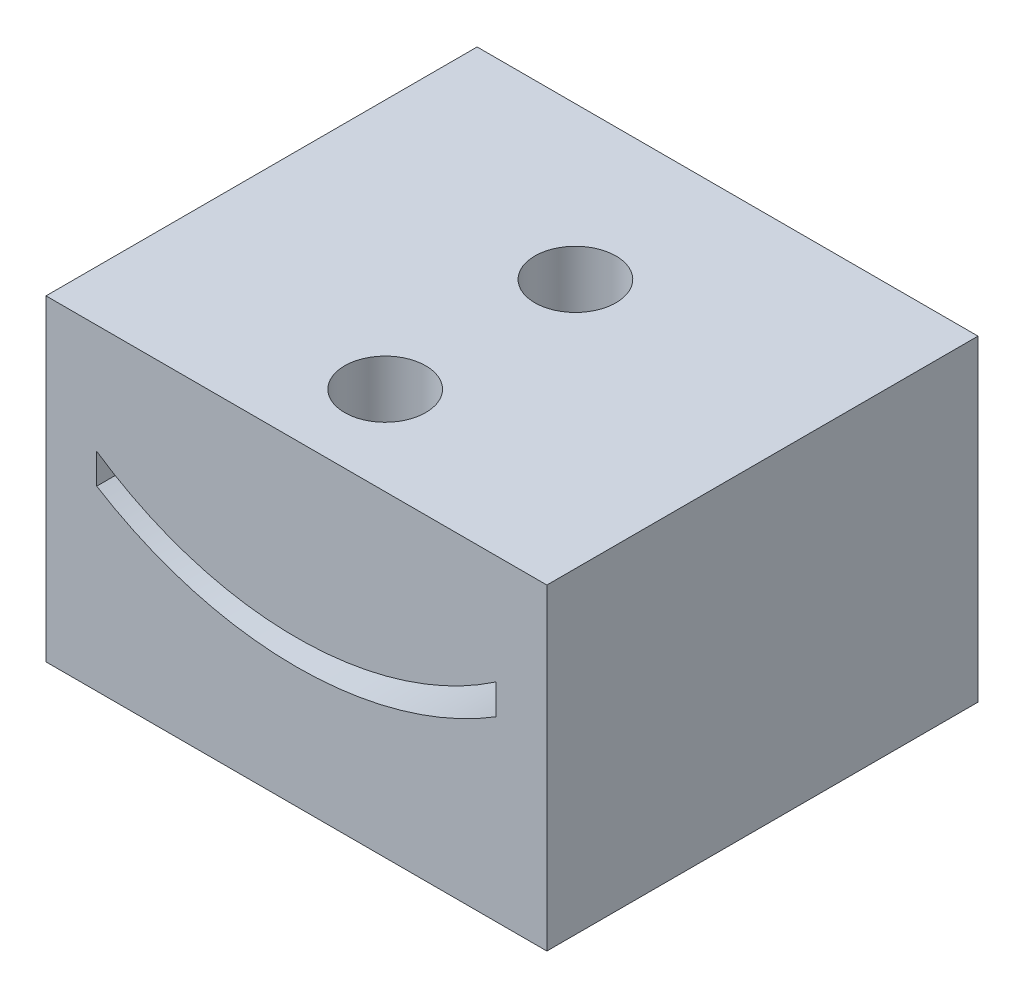
ISO-10303-21;
HEADER;
FILE_DESCRIPTION(('STEP AP214'),'2;1');
FILE_NAME('part.step','',(''),(''),'','','');
FILE_SCHEMA(('AUTOMOTIVE_DESIGN { 1 0 10303 214 1 1 1 1 }'));
ENDSEC;
DATA;
#1=APPLICATION_CONTEXT('core data for automotive mechanical design processes');
#2=APPLICATION_PROTOCOL_DEFINITION('international standard','automotive_design',2000,#1);
#3=PRODUCT_CONTEXT('',#1,'mechanical');
#4=PRODUCT('Part','Part','',(#3));
#5=PRODUCT_RELATED_PRODUCT_CATEGORY('part','',(#4));
#6=PRODUCT_DEFINITION_FORMATION('','',#4);
#7=PRODUCT_DEFINITION_CONTEXT('part definition',#1,'design');
#8=PRODUCT_DEFINITION('design','',#6,#7);
#9=PRODUCT_DEFINITION_SHAPE('','',#8);
#10=(LENGTH_UNIT() NAMED_UNIT(*) SI_UNIT(.MILLI.,.METRE.));
#11=(NAMED_UNIT(*) PLANE_ANGLE_UNIT() SI_UNIT($,.RADIAN.));
#12=(NAMED_UNIT(*) SI_UNIT($,.STERADIAN.) SOLID_ANGLE_UNIT());
#13=UNCERTAINTY_MEASURE_WITH_UNIT(LENGTH_MEASURE(1.E-05),#10,'distance_accuracy_value','');
#14=(GEOMETRIC_REPRESENTATION_CONTEXT(3) GLOBAL_UNCERTAINTY_ASSIGNED_CONTEXT((#13)) GLOBAL_UNIT_ASSIGNED_CONTEXT((#10,
#11,#12)) REPRESENTATION_CONTEXT('',''));
#15=CARTESIAN_POINT('',(0.,0.,0.));
#16=DIRECTION('',(0.,0.,1.));
#17=DIRECTION('',(1.,0.,0.));
#18=AXIS2_PLACEMENT_3D('',#15,#16,#17);
#19=CARTESIAN_POINT('',(0.,0.,15.));
#20=DIRECTION('',(0.,0.,1.));
#21=DIRECTION('',(1.,0.,0.));
#22=AXIS2_PLACEMENT_3D('',#19,#20,#21);
#23=PLANE('',#22);
#24=DIRECTION('',(0.,-1.,0.));
#25=VECTOR('',#24,1.);
#26=CARTESIAN_POINT('',(0.,12.5,15.));
#27=LINE('',#26,#25);
#28=CARTESIAN_POINT('',(0.,12.5,15.));
#29=VERTEX_POINT('',#28);
#30=CARTESIAN_POINT('',(0.,0.,15.));
#31=VERTEX_POINT('',#30);
#32=EDGE_CURVE('E110',#29,#31,#27,.T.);
#33=ORIENTED_EDGE('',*,*,#32,.T.);
#34=DIRECTION('',(1.,0.,0.));
#35=VECTOR('',#34,1.);
#36=CARTESIAN_POINT('',(0.,0.,15.));
#37=LINE('',#36,#35);
#38=CARTESIAN_POINT('',(19.75,0.,15.));
#39=VERTEX_POINT('',#38);
#40=EDGE_CURVE('E211',#31,#39,#37,.T.);
#41=ORIENTED_EDGE('',*,*,#40,.T.);
#42=DIRECTION('',(0.,1.,0.));
#43=VECTOR('',#42,1.);
#44=CARTESIAN_POINT('',(19.75,0.,15.));
#45=LINE('',#44,#43);
#46=CARTESIAN_POINT('',(19.75,12.5,15.));
#47=VERTEX_POINT('',#46);
#48=EDGE_CURVE('E213',#39,#47,#45,.T.);
#49=ORIENTED_EDGE('',*,*,#48,.T.);
#50=DIRECTION('',(-1.,0.,0.));
#51=VECTOR('',#50,1.);
#52=CARTESIAN_POINT('',(19.75,12.5,15.));
#53=LINE('',#52,#51);
#54=EDGE_CURVE('E63',#47,#29,#53,.T.);
#55=ORIENTED_EDGE('',*,*,#54,.T.);
#56=EDGE_LOOP('',(#33,#41,#49,#55));
#57=FACE_BOUND('',#56,.T.);
#58=DIRECTION('',(0.,-1.,0.));
#59=VECTOR('',#58,1.);
#60=CARTESIAN_POINT('',(2.,8.19137141200432,15.));
#61=LINE('',#60,#59);
#62=CARTESIAN_POINT('',(2.,8.19137141200432,15.));
#63=VERTEX_POINT('',#62);
#64=CARTESIAN_POINT('',(2.,7.,15.));
#65=VERTEX_POINT('',#64);
#66=EDGE_CURVE('E245',#63,#65,#61,.T.);
#67=ORIENTED_EDGE('',*,*,#66,.F.);
#68=CARTESIAN_POINT('',(9.875,19.7665333979119,15.));
#69=DIRECTION('',(0.,0.,-1.));
#70=DIRECTION('',(1.,0.,0.));
#71=AXIS2_PLACEMENT_3D('',#68,#69,#70);
#72=CIRCLE('',#71,14.);
#73=CARTESIAN_POINT('',(17.75,8.19137141200432,15.));
#74=VERTEX_POINT('',#73);
#75=EDGE_CURVE('E232',#74,#63,#72,.T.);
#76=ORIENTED_EDGE('',*,*,#75,.F.);
#77=DIRECTION('',(0.,1.,0.));
#78=VECTOR('',#77,1.);
#79=CARTESIAN_POINT('',(17.75,8.19137141200432,15.));
#80=LINE('',#79,#78);
#81=CARTESIAN_POINT('',(17.75,7.,15.));
#82=VERTEX_POINT('',#81);
#83=EDGE_CURVE('E228',#82,#74,#80,.T.);
#84=ORIENTED_EDGE('',*,*,#83,.F.);
#85=CARTESIAN_POINT('',(9.875,19.7665333979119,15.));
#86=DIRECTION('',(0.,0.,1.));
#87=DIRECTION('',(1.,0.,0.));
#88=AXIS2_PLACEMENT_3D('',#85,#86,#87);
#89=CIRCLE('',#88,15.);
#90=EDGE_CURVE('E243',#65,#82,#89,.T.);
#91=ORIENTED_EDGE('',*,*,#90,.F.);
#92=EDGE_LOOP('',(#67,#76,#84,#91));
#93=FACE_BOUND('',#92,.T.);
#94=ADVANCED_FACE('F33',(#57,#93),#23,.T.);
#95=CARTESIAN_POINT('',(0.,12.5,15.));
#96=DIRECTION('',(1.,0.,0.));
#97=DIRECTION('',(0.,0.,-1.));
#98=AXIS2_PLACEMENT_3D('',#95,#96,#97);
#99=PLANE('',#98);
#100=DIRECTION('',(0.,0.,-1.));
#101=VECTOR('',#100,1.);
#102=CARTESIAN_POINT('',(0.,12.5,15.));
#103=LINE('',#102,#101);
#104=CARTESIAN_POINT('',(0.,12.5,-2.));
#105=VERTEX_POINT('',#104);
#106=EDGE_CURVE('E105',#29,#105,#103,.T.);
#107=ORIENTED_EDGE('',*,*,#106,.T.);
#108=DIRECTION('',(0.,1.,0.));
#109=VECTOR('',#108,1.);
#110=CARTESIAN_POINT('',(0.,12.5,-2.));
#111=LINE('',#110,#109);
#112=CARTESIAN_POINT('',(0.,0.,-2.));
#113=VERTEX_POINT('',#112);
#114=EDGE_CURVE('E109',#113,#105,#111,.T.);
#115=ORIENTED_EDGE('',*,*,#114,.F.);
#116=DIRECTION('',(0.,0.,-1.));
#117=VECTOR('',#116,1.);
#118=CARTESIAN_POINT('',(0.,0.,15.));
#119=LINE('',#118,#117);
#120=EDGE_CURVE('E11',#31,#113,#119,.T.);
#121=ORIENTED_EDGE('',*,*,#120,.F.);
#122=ORIENTED_EDGE('',*,*,#32,.F.);
#123=EDGE_LOOP('',(#107,#115,#121,#122));
#124=FACE_BOUND('',#123,.T.);
#125=ADVANCED_FACE('F35',(#124),#99,.F.);
#126=CARTESIAN_POINT('',(0.,0.,15.));
#127=DIRECTION('',(0.,1.,0.));
#128=DIRECTION('',(0.,0.,1.));
#129=AXIS2_PLACEMENT_3D('',#126,#127,#128);
#130=PLANE('',#129);
#131=CARTESIAN_POINT('',(9.875,0.,11.5));
#132=DIRECTION('',(0.,1.,0.));
#133=DIRECTION('',(-1.,0.,0.));
#134=AXIS2_PLACEMENT_3D('',#131,#132,#133);
#135=CIRCLE('',#134,1.59999999999999);
#136=CARTESIAN_POINT('',(8.27500000000001,0.,11.5));
#137=VERTEX_POINT('',#136);
#138=EDGE_CURVE('E132',#137,#137,#135,.T.);
#139=ORIENTED_EDGE('',*,*,#138,.T.);
#140=EDGE_LOOP('',(#139));
#141=FACE_BOUND('',#140,.T.);
#142=CARTESIAN_POINT('',(9.875,0.,4.));
#143=DIRECTION('',(0.,1.,0.));
#144=DIRECTION('',(-1.,0.,0.));
#145=AXIS2_PLACEMENT_3D('',#142,#143,#144);
#146=CIRCLE('',#145,1.6);
#147=CARTESIAN_POINT('',(8.275,0.,4.));
#148=VERTEX_POINT('',#147);
#149=EDGE_CURVE('E139',#148,#148,#146,.T.);
#150=ORIENTED_EDGE('',*,*,#149,.T.);
#151=EDGE_LOOP('',(#150));
#152=FACE_BOUND('',#151,.T.);
#153=ORIENTED_EDGE('',*,*,#120,.T.);
#154=DIRECTION('',(-1.,0.,0.));
#155=VECTOR('',#154,1.);
#156=CARTESIAN_POINT('',(0.,0.,-2.));
#157=LINE('',#156,#155);
#158=CARTESIAN_POINT('',(19.75,0.,-2.));
#159=VERTEX_POINT('',#158);
#160=EDGE_CURVE('E126',#159,#113,#157,.T.);
#161=ORIENTED_EDGE('',*,*,#160,.F.);
#162=DIRECTION('',(0.,0.,-1.));
#163=VECTOR('',#162,1.);
#164=CARTESIAN_POINT('',(19.75,0.,15.));
#165=LINE('',#164,#163);
#166=EDGE_CURVE('E47',#39,#159,#165,.T.);
#167=ORIENTED_EDGE('',*,*,#166,.F.);
#168=ORIENTED_EDGE('',*,*,#40,.F.);
#169=EDGE_LOOP('',(#153,#161,#167,#168));
#170=FACE_BOUND('',#169,.T.);
#171=ADVANCED_FACE('F193',(#141,#152,#170),#130,.F.);
#172=CARTESIAN_POINT('',(19.75,0.,15.));
#173=DIRECTION('',(-1.,0.,0.));
#174=DIRECTION('',(0.,0.,1.));
#175=AXIS2_PLACEMENT_3D('',#172,#173,#174);
#176=PLANE('',#175);
#177=ORIENTED_EDGE('',*,*,#166,.T.);
#178=DIRECTION('',(0.,-1.,0.));
#179=VECTOR('',#178,1.);
#180=CARTESIAN_POINT('',(19.75,12.5,-2.));
#181=LINE('',#180,#179);
#182=CARTESIAN_POINT('',(19.75,12.5,-2.));
#183=VERTEX_POINT('',#182);
#184=EDGE_CURVE('E121',#183,#159,#181,.T.);
#185=ORIENTED_EDGE('',*,*,#184,.F.);
#186=DIRECTION('',(0.,0.,-1.));
#187=VECTOR('',#186,1.);
#188=CARTESIAN_POINT('',(19.75,12.5,15.));
#189=LINE('',#188,#187);
#190=EDGE_CURVE('E112',#47,#183,#189,.T.);
#191=ORIENTED_EDGE('',*,*,#190,.F.);
#192=ORIENTED_EDGE('',*,*,#48,.F.);
#193=EDGE_LOOP('',(#177,#185,#191,#192));
#194=FACE_BOUND('',#193,.T.);
#195=ADVANCED_FACE('F198',(#194),#176,.F.);
#196=CARTESIAN_POINT('',(19.75,12.5,15.));
#197=DIRECTION('',(0.,-1.,0.));
#198=DIRECTION('',(1.,0.,0.));
#199=AXIS2_PLACEMENT_3D('',#196,#197,#198);
#200=PLANE('',#199);
#201=CARTESIAN_POINT('',(9.875,12.5,11.5));
#202=DIRECTION('',(0.,1.,0.));
#203=DIRECTION('',(-1.,0.,0.));
#204=AXIS2_PLACEMENT_3D('',#201,#202,#203);
#205=CIRCLE('',#204,1.59999999999999);
#206=CARTESIAN_POINT('',(8.27500000000001,12.5,11.5));
#207=VERTEX_POINT('',#206);
#208=EDGE_CURVE('E136',#207,#207,#205,.T.);
#209=ORIENTED_EDGE('',*,*,#208,.F.);
#210=EDGE_LOOP('',(#209));
#211=FACE_BOUND('',#210,.T.);
#212=CARTESIAN_POINT('',(9.875,12.5,4.));
#213=DIRECTION('',(0.,1.,0.));
#214=DIRECTION('',(-1.,0.,0.));
#215=AXIS2_PLACEMENT_3D('',#212,#213,#214);
#216=CIRCLE('',#215,1.6);
#217=CARTESIAN_POINT('',(8.275,12.5,4.));
#218=VERTEX_POINT('',#217);
#219=EDGE_CURVE('E131',#218,#218,#216,.T.);
#220=ORIENTED_EDGE('',*,*,#219,.F.);
#221=EDGE_LOOP('',(#220));
#222=FACE_BOUND('',#221,.T.);
#223=ORIENTED_EDGE('',*,*,#190,.T.);
#224=DIRECTION('',(1.,0.,0.));
#225=VECTOR('',#224,1.);
#226=CARTESIAN_POINT('',(0.,12.5,-2.));
#227=LINE('',#226,#225);
#228=EDGE_CURVE('E115',#105,#183,#227,.T.);
#229=ORIENTED_EDGE('',*,*,#228,.F.);
#230=ORIENTED_EDGE('',*,*,#106,.F.);
#231=ORIENTED_EDGE('',*,*,#54,.F.);
#232=EDGE_LOOP('',(#223,#229,#230,#231));
#233=FACE_BOUND('',#232,.T.);
#234=ADVANCED_FACE('F116',(#211,#222,#233),#200,.F.);
#235=CARTESIAN_POINT('',(9.875,19.7665333979119,15.));
#236=DIRECTION('',(0.,0.,-1.));
#237=DIRECTION('',(-1.,0.,0.));
#238=AXIS2_PLACEMENT_3D('',#235,#236,#237);
#239=CYLINDRICAL_SURFACE('',#238,14.);
#240=CARTESIAN_POINT('',(8.27500000000001,5.85826247734093,11.5));
#241=CARTESIAN_POINT('',(8.27500384213125,5.85826128964667,11.410442728502));
#242=CARTESIAN_POINT('',(8.28254457398687,5.85738813782759,11.3208280040625));
#243=CARTESIAN_POINT('',(8.31250924181524,5.85399081137164,11.144088262642));
#244=CARTESIAN_POINT('',(8.33494911718446,5.85146486858855,11.0569660163968));
#245=CARTESIAN_POINT('',(8.394045627283,5.84505172336133,10.8877959757764));
#246=CARTESIAN_POINT('',(8.43069308271434,5.84116539999515,10.8057449445715));
#247=CARTESIAN_POINT('',(8.51714569203193,5.83247045275263,10.6489743471633));
#248=CARTESIAN_POINT('',(8.56694843130505,5.82766199817507,10.5742534389857));
#249=CARTESIAN_POINT('',(8.67854904931692,5.81763925236421,10.4338963490306));
#250=CARTESIAN_POINT('',(8.74039635340954,5.81242334382822,10.3682995776674));
#251=CARTESIAN_POINT('',(8.87422436140579,5.80218799124459,10.2483927820049));
#252=CARTESIAN_POINT('',(8.94620555039944,5.79716855661649,10.1940832983154));
#253=CARTESIAN_POINT('',(9.0985032717891,5.78787537544137,10.098153407527));
#254=CARTESIAN_POINT('',(9.17884221103623,5.78360372032219,10.0565683535701));
#255=CARTESIAN_POINT('',(9.34542002143207,5.77630510348516,9.98749407515301));
#256=CARTESIAN_POINT('',(9.43165870785087,5.7732781028161,9.96000440957393));
#257=CARTESIAN_POINT('',(9.60718675336959,5.76882123197386,9.9200181259772));
#258=CARTESIAN_POINT('',(9.69646107424432,5.76738441542863,9.90745628114044));
#259=CARTESIAN_POINT('',(9.87586153106045,5.76624612279203,9.89748022286335));
#260=CARTESIAN_POINT('',(9.96598763858802,5.76654458901784,9.90006550591486));
#261=CARTESIAN_POINT('',(10.1440899902797,5.76883758387429,9.92025773817817));
#262=CARTESIAN_POINT('',(10.2320743032026,5.7708241925926,9.93779454366712));
#263=CARTESIAN_POINT('',(10.4038427563838,5.77626127391832,9.987282536397));
#264=CARTESIAN_POINT('',(10.4876268280458,5.77971177042453,10.0192339589654));
#265=CARTESIAN_POINT('',(10.6488354304286,5.78770247673082,10.0967198472193));
#266=CARTESIAN_POINT('',(10.7262450945524,5.79224514219415,10.1422849791943));
#267=CARTESIAN_POINT('',(10.8723453113415,5.8019112683774,10.2456825724453));
#268=CARTESIAN_POINT('',(10.9410355294952,5.80703475136547,10.3035155041341));
#269=CARTESIAN_POINT('',(11.0681585218928,5.81732296512151,10.4302006444098));
#270=CARTESIAN_POINT('',(11.1265304366148,5.82248776428959,10.4991139343199));
#271=CARTESIAN_POINT('',(11.2308876915739,5.8322474689764,10.6457928861353));
#272=CARTESIAN_POINT('',(11.2768730035632,5.83684237319545,10.7235585682279));
#273=CARTESIAN_POINT('',(11.3551534522796,5.84494216286489,10.8857856482052));
#274=CARTESIAN_POINT('',(11.3874442230352,5.84844670059964,10.9702491712642));
#275=CARTESIAN_POINT('',(11.4373676595695,5.85396196610257,11.1434484612265));
#276=CARTESIAN_POINT('',(11.4550009125142,5.85597275370858,11.232184056844));
#277=CARTESIAN_POINT('',(11.4750292274783,5.8582621419236,11.4108725791944));
#278=CARTESIAN_POINT('',(11.47750970681,5.85855045206313,11.5008158123992));
#279=CARTESIAN_POINT('',(11.4673869601989,5.85738789197566,11.6798365807296));
#280=CARTESIAN_POINT('',(11.4547840018748,5.8559370526056,11.7689141311862));
#281=CARTESIAN_POINT('',(11.414923845945,5.85146851164256,11.9434221683455));
#282=CARTESIAN_POINT('',(11.3877075657673,5.84845518582897,12.0288621228458));
#283=CARTESIAN_POINT('',(11.3194352965523,5.84120474047475,12.1939649670849));
#284=CARTESIAN_POINT('',(11.2783788975106,5.83696758467951,12.2736276855919));
#285=CARTESIAN_POINT('',(11.1833800140816,5.82772352159333,12.4253024960505));
#286=CARTESIAN_POINT('',(11.1293812469639,5.82271328727577,12.497279130285));
#287=CARTESIAN_POINT('',(11.0101105185695,5.81249823063827,12.6311778466069));
#288=CARTESIAN_POINT('',(10.9448381918396,5.80729340201449,12.6930996026208));
#289=CARTESIAN_POINT('',(10.8045012148443,5.79724600769122,12.8054283865396));
#290=CARTESIAN_POINT('',(10.7293916357643,5.79240527514782,12.8557794701613));
#291=CARTESIAN_POINT('',(10.5717322811123,5.78365855903046,12.9431515033549));
#292=CARTESIAN_POINT('',(10.4891826341061,5.7797525593084,12.9801726832149));
#293=CARTESIAN_POINT('',(10.3191765840406,5.77332360336256,13.0397405289919));
#294=CARTESIAN_POINT('',(10.2317318653686,5.77079749657363,13.0623201880495));
#295=CARTESIAN_POINT('',(10.0542617729755,5.76739993323266,13.0924715356154));
#296=CARTESIAN_POINT('',(9.96423649572859,5.76652841490554,13.1000437844351));
#297=CARTESIAN_POINT('',(9.7847084789975,5.76653839630182,13.0999560820019));
#298=CARTESIAN_POINT('',(9.69520568424396,5.76740993811171,13.0923826563604));
#299=CARTESIAN_POINT('',(9.51875329695932,5.77078839889435,13.062401017074));
#300=CARTESIAN_POINT('',(9.4318037045447,5.77329531794174,13.0399928027521));
#301=CARTESIAN_POINT('',(9.26293245513661,5.77966393297297,12.9810034282225));
#302=CARTESIAN_POINT('',(9.18100958856742,5.78352530152308,12.9444256932273));
#303=CARTESIAN_POINT('',(9.02445170184352,5.79217394694049,12.8581445868167));
#304=CARTESIAN_POINT('',(8.94981671012244,5.79696122742,12.8084411641943));
#305=CARTESIAN_POINT('',(8.80951031511158,5.80695911974167,12.6969971905688));
#306=CARTESIAN_POINT('',(8.74389026863449,5.8121719074873,12.6351921745559));
#307=CARTESIAN_POINT('',(8.62391735924705,5.82241536869784,12.5014312134515));
#308=CARTESIAN_POINT('',(8.56956718322703,5.82744599849841,12.429472854521));
#309=CARTESIAN_POINT('',(8.47353025907042,5.8367729808653,12.2771843010794));
#310=CARTESIAN_POINT('',(8.43188520434726,5.84106689606296,12.1968276805101));
#311=CARTESIAN_POINT('',(8.36273756888819,5.84840556481368,12.0302605301055));
#312=CARTESIAN_POINT('',(8.33521934603298,5.85145169922954,11.9440565950922));
#313=CARTESIAN_POINT('',(8.30182018895584,5.8551971918773,11.7978222984969));
#314=CARTESIAN_POINT('',(8.29177675037753,5.85634108208906,11.738720363865));
#315=CARTESIAN_POINT('',(8.27836539104181,5.85787411970507,11.6197541808706));
#316=CARTESIAN_POINT('',(8.27499743063859,5.85826327159173,11.5598899370376));
#317=CARTESIAN_POINT('',(8.27500000000001,5.85826247734093,11.5));
#318=B_SPLINE_CURVE_WITH_KNOTS('',3,(#240,#241,#242,#243,#244,#245,#246,#247,#248,#249,#250,
#251,#252,#253,#254,#255,#256,#257,#258,#259,#260,#261,#262,#263,#264,#265,#266,#267,#268,#269,
#270,#271,#272,#273,#274,#275,#276,#277,#278,#279,#280,#281,#282,#283,#284,#285,#286,#287,#288,
#289,#290,#291,#292,#293,#294,#295,#296,#297,#298,#299,#300,#301,#302,#303,#304,#305,#306,#307,
#308,#309,#310,#311,#312,#313,#314,#315,#316,#317),.UNSPECIFIED.,.T.,.F.,(4,2,2,2,2,2,2,2,2,2,2,
2,2,2,2,2,2,2,2,2,2,2,2,2,2,2,2,2,2,2,2,2,2,2,2,2,2,2,4),(0.,0.268453064535888,
0.537193789185938,0.805761173188709,1.0742792966604,1.34392344020704,1.61358049550318,
1.88398009318921,2.1543712281314,2.42357649846968,2.69277282016196,2.96071313724902,
3.22865782878445,3.49721070341086,3.76577387764978,4.03587176209593,4.30597026250062,
4.57615480868442,4.84632853101355,5.1149778479811,5.38362239849345,5.65151863490207,
5.91942280825797,6.18851386342146,6.45761364330046,6.72798836105338,6.99835840757374,
7.26810853844353,7.53784859782742,7.80605206330065,8.07425554101041,8.34239422604136,
8.61053395717348,8.88014295777529,9.14981616310985,9.42036504393079,9.69061370630474,
9.87013829822211,10.0496618239356),.UNSPECIFIED.);
#319=CARTESIAN_POINT('',(8.27500000000001,5.85826247734093,11.5));
#320=VERTEX_POINT('',#319);
#321=EDGE_CURVE('E152',#320,#320,#318,.T.);
#322=ORIENTED_EDGE('',*,*,#321,.F.);
#323=EDGE_LOOP('',(#322));
#324=FACE_BOUND('',#323,.T.);
#325=CARTESIAN_POINT('',(8.275,5.85826247734093,4.));
#326=CARTESIAN_POINT('',(8.27500384213125,5.85826128964667,3.91044272850198));
#327=CARTESIAN_POINT('',(8.28254457398687,5.85738813782759,3.82082800406246));
#328=CARTESIAN_POINT('',(8.31250924181523,5.85399081137164,3.64408826264202));
#329=CARTESIAN_POINT('',(8.33494911718445,5.85146486858856,3.55696601639683));
#330=CARTESIAN_POINT('',(8.394045627283,5.84505172336133,3.38779597577638));
#331=CARTESIAN_POINT('',(8.43069308271433,5.84116539999515,3.30574494457153));
#332=CARTESIAN_POINT('',(8.51714569203192,5.83247045275263,3.1489743471633));
#333=CARTESIAN_POINT('',(8.56694843130504,5.82766199817507,3.07425343898572));
#334=CARTESIAN_POINT('',(8.67854904931692,5.81763925236421,2.93389634903063));
#335=CARTESIAN_POINT('',(8.74039635340953,5.81242334382822,2.86829957766737));
#336=CARTESIAN_POINT('',(8.87422436140578,5.80218799124459,2.74839278200494));
#337=CARTESIAN_POINT('',(8.94620555039944,5.7971685566165,2.69408329831535));
#338=CARTESIAN_POINT('',(9.0985032717891,5.78787537544137,2.59815340752695));
#339=CARTESIAN_POINT('',(9.17884221103623,5.78360372032219,2.55656835357006));
#340=CARTESIAN_POINT('',(9.34542002143207,5.77630510348516,2.487494075153));
#341=CARTESIAN_POINT('',(9.43165870785087,5.7732781028161,2.46000440957392));
#342=CARTESIAN_POINT('',(9.60718675336958,5.76882123197386,2.4200181259772));
#343=CARTESIAN_POINT('',(9.69646107424432,5.76738441542863,2.40745628114043));
#344=CARTESIAN_POINT('',(9.87586153106045,5.76624612279203,2.39748022286335));
#345=CARTESIAN_POINT('',(9.96598763858802,5.76654458901784,2.40006550591486));
#346=CARTESIAN_POINT('',(10.1440899902797,5.76883758387429,2.42025773817816));
#347=CARTESIAN_POINT('',(10.2320743032026,5.7708241925926,2.43779454366711));
#348=CARTESIAN_POINT('',(10.4038427563838,5.77626127391832,2.48728253639699));
#349=CARTESIAN_POINT('',(10.4876268280458,5.77971177042453,2.5192339589654));
#350=CARTESIAN_POINT('',(10.6488354304286,5.78770247673082,2.59671984721925));
#351=CARTESIAN_POINT('',(10.7262450945524,5.79224514219415,2.64228497919433));
#352=CARTESIAN_POINT('',(10.8723453113415,5.8019112683774,2.7456825724453));
#353=CARTESIAN_POINT('',(10.9410355294952,5.80703475136547,2.80351550413411));
#354=CARTESIAN_POINT('',(11.0681585218928,5.81732296512151,2.93020064440976));
#355=CARTESIAN_POINT('',(11.1265304366148,5.8224877642896,2.99911393431994));
#356=CARTESIAN_POINT('',(11.2308876915739,5.8322474689764,3.14579288613528));
#357=CARTESIAN_POINT('',(11.2768730035632,5.83684237319545,3.22355856822791));
#358=CARTESIAN_POINT('',(11.3551534522796,5.84494216286489,3.38578564820524));
#359=CARTESIAN_POINT('',(11.3874442230352,5.84844670059964,3.47024917126422));
#360=CARTESIAN_POINT('',(11.4373676595695,5.85396196610257,3.64344846122649));
#361=CARTESIAN_POINT('',(11.4550009125142,5.85597275370859,3.73218405684399));
#362=CARTESIAN_POINT('',(11.4750292274783,5.8582621419236,3.91087257919436));
#363=CARTESIAN_POINT('',(11.47750970681,5.85855045206313,4.00081581239921));
#364=CARTESIAN_POINT('',(11.4673869601989,5.85738789197566,4.17983658072955));
#365=CARTESIAN_POINT('',(11.4547840018748,5.8559370526056,4.2689141311862));
#366=CARTESIAN_POINT('',(11.414923845945,5.85146851164256,4.44342216834547));
#367=CARTESIAN_POINT('',(11.3877075657673,5.84845518582897,4.52886212284577));
#368=CARTESIAN_POINT('',(11.3194352965523,5.84120474047475,4.69396496708485));
#369=CARTESIAN_POINT('',(11.2783788975106,5.83696758467951,4.77362768559186));
#370=CARTESIAN_POINT('',(11.1833800140816,5.82772352159333,4.92530249605051));
#371=CARTESIAN_POINT('',(11.1293812469639,5.82271328727577,4.99727913028498));
#372=CARTESIAN_POINT('',(11.0101105185695,5.81249823063827,5.1311778466069));
#373=CARTESIAN_POINT('',(10.9448381918396,5.80729340201449,5.19309960262082));
#374=CARTESIAN_POINT('',(10.8045012148443,5.79724600769122,5.30542838653963));
#375=CARTESIAN_POINT('',(10.7293916357643,5.79240527514782,5.35577947016132));
#376=CARTESIAN_POINT('',(10.5717322811123,5.78365855903046,5.44315150335491));
#377=CARTESIAN_POINT('',(10.4891826341061,5.7797525593084,5.48017268321496));
#378=CARTESIAN_POINT('',(10.3191765840406,5.77332360336256,5.5397405289919));
#379=CARTESIAN_POINT('',(10.2317318653686,5.77079749657363,5.56232018804953));
#380=CARTESIAN_POINT('',(10.0542617729755,5.76739993323266,5.59247153561541));
#381=CARTESIAN_POINT('',(9.96423649572859,5.76652841490554,5.60004378443507));
#382=CARTESIAN_POINT('',(9.7847084789975,5.76653839630182,5.59995608200187));
#383=CARTESIAN_POINT('',(9.69520568424396,5.7674099381117,5.59238265636045));
#384=CARTESIAN_POINT('',(9.51875329695932,5.77078839889435,5.56240101707396));
#385=CARTESIAN_POINT('',(9.4318037045447,5.77329531794173,5.53999280275207));
#386=CARTESIAN_POINT('',(9.26293245513661,5.77966393297297,5.48100342822254));
#387=CARTESIAN_POINT('',(9.18100958856742,5.78352530152309,5.44442569322729));
#388=CARTESIAN_POINT('',(9.02445170184352,5.79217394694049,5.35814458681668));
#389=CARTESIAN_POINT('',(8.94981671012244,5.79696122742,5.30844116419426));
#390=CARTESIAN_POINT('',(8.80951031511158,5.80695911974168,5.19699719056883));
#391=CARTESIAN_POINT('',(8.74389026863449,5.8121719074873,5.1351921745559));
#392=CARTESIAN_POINT('',(8.62391735924704,5.82241536869784,5.00143121345148));
#393=CARTESIAN_POINT('',(8.56956718322703,5.82744599849841,4.92947285452105));
#394=CARTESIAN_POINT('',(8.47353025907042,5.8367729808653,4.77718430107941));
#395=CARTESIAN_POINT('',(8.43188520434725,5.84106689606296,4.69682768051012));
#396=CARTESIAN_POINT('',(8.36273756888819,5.84840556481368,4.53026053010554));
#397=CARTESIAN_POINT('',(8.33521934603297,5.85145169922954,4.44405659509217));
#398=CARTESIAN_POINT('',(8.30182018895583,5.8551971918773,4.29782229849686));
#399=CARTESIAN_POINT('',(8.29177675037752,5.85634108208907,4.23872036386501));
#400=CARTESIAN_POINT('',(8.27836539104181,5.85787411970507,4.11975418087063));
#401=CARTESIAN_POINT('',(8.27499743063859,5.85826327159173,4.05988993703759));
#402=CARTESIAN_POINT('',(8.275,5.85826247734093,4.));
#403=B_SPLINE_CURVE_WITH_KNOTS('',3,(#325,#326,#327,#328,#329,#330,#331,#332,#333,#334,#335,
#336,#337,#338,#339,#340,#341,#342,#343,#344,#345,#346,#347,#348,#349,#350,#351,#352,#353,#354,
#355,#356,#357,#358,#359,#360,#361,#362,#363,#364,#365,#366,#367,#368,#369,#370,#371,#372,#373,
#374,#375,#376,#377,#378,#379,#380,#381,#382,#383,#384,#385,#386,#387,#388,#389,#390,#391,#392,
#393,#394,#395,#396,#397,#398,#399,#400,#401,#402),.UNSPECIFIED.,.T.,.F.,(4,2,2,2,2,2,2,2,2,2,2,
2,2,2,2,2,2,2,2,2,2,2,2,2,2,2,2,2,2,2,2,2,2,2,2,2,2,2,4),(0.,0.26845306453589,0.53719378918594,
0.805761173188711,1.07427929666041,1.34392344020705,1.61358049550319,1.88398009318922,
2.15437122813141,2.42357649846968,2.69277282016197,2.96071313724903,3.22865782878446,
3.49721070341088,3.76577387764979,4.03587176209595,4.30597026250064,4.57615480868443,
4.84632853101357,5.11497784798112,5.38362239849347,5.65151863490209,5.91942280825799,
6.18851386342149,6.45761364330048,6.72798836105341,6.99835840757377,7.26810853844356,
7.53784859782745,7.80605206330069,8.07425554101044,8.34239422604139,8.61053395717352,
8.88014295777533,9.14981616310989,9.42036504393083,9.69061370630478,9.87013829822215,
10.0496618239356),.UNSPECIFIED.);
#404=CARTESIAN_POINT('',(8.275,5.85826247734093,4.));
#405=VERTEX_POINT('',#404);
#406=EDGE_CURVE('E144',#405,#405,#403,.T.);
#407=ORIENTED_EDGE('',*,*,#406,.F.);
#408=EDGE_LOOP('',(#407));
#409=FACE_BOUND('',#408,.T.);
#410=CARTESIAN_POINT('',(9.875,19.7665333979119,0.));
#411=DIRECTION('',(0.,0.,-1.));
#412=DIRECTION('',(1.,0.,0.));
#413=AXIS2_PLACEMENT_3D('',#410,#411,#412);
#414=CIRCLE('',#413,14.);
#415=CARTESIAN_POINT('',(17.75,8.19137141200432,0.));
#416=VERTEX_POINT('',#415);
#417=CARTESIAN_POINT('',(2.,8.19137141200432,0.));
#418=VERTEX_POINT('',#417);
#419=EDGE_CURVE('E239',#416,#418,#414,.T.);
#420=ORIENTED_EDGE('',*,*,#419,.F.);
#421=DIRECTION('',(0.,0.,-1.));
#422=VECTOR('',#421,1.);
#423=CARTESIAN_POINT('',(17.75,8.19137141200432,15.));
#424=LINE('',#423,#422);
#425=EDGE_CURVE('E226',#74,#416,#424,.T.);
#426=ORIENTED_EDGE('',*,*,#425,.F.);
#427=ORIENTED_EDGE('',*,*,#75,.T.);
#428=DIRECTION('',(0.,0.,-1.));
#429=VECTOR('',#428,1.);
#430=CARTESIAN_POINT('',(2.,8.19137141200432,15.));
#431=LINE('',#430,#429);
#432=EDGE_CURVE('E215',#63,#418,#431,.T.);
#433=ORIENTED_EDGE('',*,*,#432,.T.);
#434=EDGE_LOOP('',(#420,#426,#427,#433));
#435=FACE_BOUND('',#434,.T.);
#436=ADVANCED_FACE('F157',(#324,#409,#435),#239,.T.);
#437=CARTESIAN_POINT('',(2.,8.19137141200432,15.));
#438=DIRECTION('',(1.,0.,0.));
#439=DIRECTION('',(0.,1.,0.));
#440=AXIS2_PLACEMENT_3D('',#437,#438,#439);
#441=PLANE('',#440);
#442=DIRECTION('',(0.,-1.,0.));
#443=VECTOR('',#442,1.);
#444=CARTESIAN_POINT('',(2.,8.19137141200432,0.));
#445=LINE('',#444,#443);
#446=CARTESIAN_POINT('',(2.,7.,0.));
#447=VERTEX_POINT('',#446);
#448=EDGE_CURVE('E236',#418,#447,#445,.T.);
#449=ORIENTED_EDGE('',*,*,#448,.F.);
#450=ORIENTED_EDGE('',*,*,#432,.F.);
#451=ORIENTED_EDGE('',*,*,#66,.T.);
#452=DIRECTION('',(0.,0.,-1.));
#453=VECTOR('',#452,1.);
#454=CARTESIAN_POINT('',(2.,7.,15.));
#455=LINE('',#454,#453);
#456=EDGE_CURVE('E218',#65,#447,#455,.T.);
#457=ORIENTED_EDGE('',*,*,#456,.T.);
#458=EDGE_LOOP('',(#449,#450,#451,#457));
#459=FACE_BOUND('',#458,.T.);
#460=ADVANCED_FACE('F180',(#459),#441,.T.);
#461=CARTESIAN_POINT('',(9.875,19.7665333979119,15.));
#462=DIRECTION('',(0.,0.,-1.));
#463=DIRECTION('',(-1.,0.,0.));
#464=AXIS2_PLACEMENT_3D('',#461,#462,#463);
#465=CYLINDRICAL_SURFACE('',#464,15.);
#466=CARTESIAN_POINT('',(8.27500000000001,4.85211084791017,11.5));
#467=CARTESIAN_POINT('',(8.27500386490435,4.85210973231864,11.5895979909748));
#468=CARTESIAN_POINT('',(8.28255142164014,4.85129475614942,11.6792544311774));
#469=CARTESIAN_POINT('',(8.31254479676637,4.84812355028356,11.8560792558271));
#470=CARTESIAN_POINT('',(8.33500682525146,4.84576564366227,11.9432448253866));
#471=CARTESIAN_POINT('',(8.39416561060583,4.83977862793566,12.1125017515014));
#472=CARTESIAN_POINT('',(8.43085348522247,4.83615031217802,12.1945962373046));
#473=CARTESIAN_POINT('',(8.51740495740207,4.82803226862738,12.3514452386401));
#474=CARTESIAN_POINT('',(8.56726602782523,4.82354270610076,12.4262011582308));
#475=CARTESIAN_POINT('',(8.67896881980184,4.81418732900885,12.5665758402884));
#476=CARTESIAN_POINT('',(8.74085378573159,4.80932019563581,12.6321601067378));
#477=CARTESIAN_POINT('',(8.87475505070068,4.79977002008359,12.7520324947359));
#478=CARTESIAN_POINT('',(8.94677182270953,4.79508698651157,12.8063200886437));
#479=CARTESIAN_POINT('',(9.09910533411287,4.78641949393275,12.9021786430043));
#480=CARTESIAN_POINT('',(9.17944151516082,4.78243673272803,12.943718874349));
#481=CARTESIAN_POINT('',(9.34599868492978,4.77563292717412,13.0127068893861));
#482=CARTESIAN_POINT('',(9.43221951183117,4.77281185089519,13.0401550604139));
#483=CARTESIAN_POINT('',(9.6077486198603,4.76865854045246,13.0800780823318));
#484=CARTESIAN_POINT('',(9.69704383038619,4.76732065288858,13.0926098031093));
#485=CARTESIAN_POINT('',(9.87647934742903,4.76626521523622,13.102520230435));
#486=CARTESIAN_POINT('',(9.96661962917293,4.76654761779669,13.0998993797988));
#487=CARTESIAN_POINT('',(10.1448002654789,4.76869632758197,13.0796250798513));
#488=CARTESIAN_POINT('',(10.2328476670565,4.77055619120829,13.0620327847732));
#489=CARTESIAN_POINT('',(10.4047330628302,4.77564347166824,13.0124103270674));
#490=CARTESIAN_POINT('',(10.4885709959323,4.77887090834372,12.9803799549602));
#491=CARTESIAN_POINT('',(10.649849526652,4.78634163483518,12.9027240121127));
#492=CARTESIAN_POINT('',(10.7272770678848,4.79058693247627,12.8570715264149));
#493=CARTESIAN_POINT('',(10.8733944733948,4.79961736073699,12.7534868135453));
#494=CARTESIAN_POINT('',(10.9420840457706,4.80440250938088,12.6955541763138));
#495=CARTESIAN_POINT('',(11.0691341298645,4.81400412533631,12.5687100656952));
#496=CARTESIAN_POINT('',(11.1274415145368,4.81882062996377,12.499745368818));
#497=CARTESIAN_POINT('',(11.2316603927018,4.82791840139707,12.3529789057692));
#498=CARTESIAN_POINT('',(11.2775718638972,4.83219966724015,12.2751771237021));
#499=CARTESIAN_POINT('',(11.3556962031062,4.83974248034006,12.1129025765094));
#500=CARTESIAN_POINT('',(11.3879055511256,4.84300376551301,12.0284281038093));
#501=CARTESIAN_POINT('',(11.4376680602887,4.84813201078799,11.8552273498699));
#502=CARTESIAN_POINT('',(11.4552217309736,4.84999901936531,11.7665012165635));
#503=CARTESIAN_POINT('',(11.4751057684296,4.85211879757871,11.5877828377103));
#504=CARTESIAN_POINT('',(11.4775105678172,4.85237945971593,11.4977989633311));
#505=CARTESIAN_POINT('',(11.4672243002794,4.85127786930767,11.3187095584643));
#506=CARTESIAN_POINT('',(11.4545334659999,4.8499156417733,11.2296040144617));
#507=CARTESIAN_POINT('',(11.4144785499504,4.84572894519008,11.0550190997279));
#508=CARTESIAN_POINT('',(11.3871498701768,4.84290800464204,10.9695315148821));
#509=CARTESIAN_POINT('',(11.3186312387828,4.83612459066206,10.804353467697));
#510=CARTESIAN_POINT('',(11.2774409274696,4.83216208760832,10.7246631558553));
#511=CARTESIAN_POINT('',(11.1821826627936,4.82352296271262,10.5730031169419));
#512=CARTESIAN_POINT('',(11.1280655114431,4.81884363775155,10.5010644477186));
#513=CARTESIAN_POINT('',(11.0085600306394,4.80930686447811,10.3672651927035));
#514=CARTESIAN_POINT('',(10.9431713833856,4.80444941114642,10.3054048911677));
#515=CARTESIAN_POINT('',(10.8026555932755,4.79507976072961,10.1932605027302));
#516=CARTESIAN_POINT('',(10.7274895140471,4.7905690653578,10.1430250596509));
#517=CARTESIAN_POINT('',(10.569744134251,4.78242316379446,10.0558915717958));
#518=CARTESIAN_POINT('',(10.4871649473399,4.77878794418343,10.01899332258));
#519=CARTESIAN_POINT('',(10.3171052632514,4.77280933500209,9.95966353949535));
#520=CARTESIAN_POINT('',(10.2296350020787,4.77046335115816,9.93720293779243));
#521=CARTESIAN_POINT('',(10.0521383730751,4.76731686363524,9.90729122676453));
#522=CARTESIAN_POINT('',(9.9621120877836,4.76651631010851,9.89983963332493));
#523=CARTESIAN_POINT('',(9.78253601210011,4.76655095991907,9.90016481150351));
#524=CARTESIAN_POINT('',(9.69298607413305,4.76737806550034,9.90786619561159));
#525=CARTESIAN_POINT('',(9.51646008629147,4.77055909988405,9.9381202428258));
#526=CARTESIAN_POINT('',(9.42948403763233,4.77291302940744,9.96067291294456));
#527=CARTESIAN_POINT('',(9.26057767244467,4.77888409984771,10.0199677474486));
#528=CARTESIAN_POINT('',(9.17864644840021,4.78250101278035,10.0567073510421));
#529=CARTESIAN_POINT('',(9.02210133886545,4.79059552963758,10.1433252239084));
#530=CARTESIAN_POINT('',(8.94748744288826,4.79507313232865,10.193203474351));
#531=CARTESIAN_POINT('',(8.80730882104991,4.80441448813095,10.3049647495156));
#532=CARTESIAN_POINT('',(8.74178899120213,4.80927998249002,10.3669039420439));
#533=CARTESIAN_POINT('',(8.62204083702456,4.81883418142201,10.5009159737978));
#534=CARTESIAN_POINT('',(8.56781521633386,4.82352284344484,10.5729912325216));
#535=CARTESIAN_POINT('',(8.47206933969376,4.83220681630662,10.7254581913491));
#536=CARTESIAN_POINT('',(8.43058581322716,4.83620010865406,10.8058730557096));
#537=CARTESIAN_POINT('',(8.36176701580473,4.84301729963458,10.9725201165262));
#538=CARTESIAN_POINT('',(8.33441592576068,4.84584250505002,11.0587456859963));
#539=CARTESIAN_POINT('',(8.30139266479223,4.84929760394737,11.2045413847555));
#540=CARTESIAN_POINT('',(8.29150911202548,4.85034751738685,11.2631822269006));
#541=CARTESIAN_POINT('',(8.27831151455109,4.85175450750854,11.381206815939));
#542=CARTESIAN_POINT('',(8.27499743731079,4.85211158762173,11.4405905591517));
#543=CARTESIAN_POINT('',(8.27500000000001,4.85211084791017,11.5));
#544=B_SPLINE_CURVE_WITH_KNOTS('',3,(#466,#467,#468,#469,#470,#471,#472,#473,#474,#475,#476,
#477,#478,#479,#480,#481,#482,#483,#484,#485,#486,#487,#488,#489,#490,#491,#492,#493,#494,#495,
#496,#497,#498,#499,#500,#501,#502,#503,#504,#505,#506,#507,#508,#509,#510,#511,#512,#513,#514,
#515,#516,#517,#518,#519,#520,#521,#522,#523,#524,#525,#526,#527,#528,#529,#530,#531,#532,#533,
#534,#535,#536,#537,#538,#539,#540,#541,#542,#543),.UNSPECIFIED.,.T.,.F.,(4,2,2,2,2,2,2,2,2,2,2,
2,2,2,2,2,2,2,2,2,2,2,2,2,2,2,2,2,2,2,2,2,2,2,2,2,2,2,4),(0.,0.268577001529119,
0.537446390261955,0.806148173479045,1.07479844645294,1.34443343913401,1.61408102300265,
1.88437361023823,2.154658767793,2.42391011167973,2.69315358705863,2.96130252668383,
3.22945535696218,3.49814155961666,3.76683673567382,4.03686964273637,4.3069030355216,
4.57700575645422,4.84709908619819,5.11586429481951,5.38462536142937,5.65273933841565,
5.92086027317741,6.19001837516272,6.45918406732217,6.7294564899683,6.99972476955151,
7.26944718972386,7.53916090987705,7.8075361711647,8.0759115591766,8.34423852710789,
8.61256511047854,8.88217254048785,9.15184443588196,9.42228652782282,9.69242524206727,
9.8705105800108,10.0485950360566),.UNSPECIFIED.);
#545=CARTESIAN_POINT('',(8.27500000000001,4.85211084791017,11.5));
#546=VERTEX_POINT('',#545);
#547=EDGE_CURVE('E37',#546,#546,#544,.T.);
#548=ORIENTED_EDGE('',*,*,#547,.F.);
#549=EDGE_LOOP('',(#548));
#550=FACE_BOUND('',#549,.T.);
#551=CARTESIAN_POINT('',(8.275,4.85211084791017,4.));
#552=CARTESIAN_POINT('',(8.27500386490434,4.85210973231864,4.08959799097481));
#553=CARTESIAN_POINT('',(8.28255142164013,4.85129475614942,4.17925443117745));
#554=CARTESIAN_POINT('',(8.31254479676636,4.84812355028356,4.35607925582709));
#555=CARTESIAN_POINT('',(8.33500682525145,4.84576564366227,4.44324482538657));
#556=CARTESIAN_POINT('',(8.39416561060582,4.83977862793566,4.61250175150137));
#557=CARTESIAN_POINT('',(8.43085348522246,4.83615031217802,4.69459623730464));
#558=CARTESIAN_POINT('',(8.51740495740206,4.82803226862738,4.85144523864014));
#559=CARTESIAN_POINT('',(8.56726602782523,4.82354270610076,4.92620115823081));
#560=CARTESIAN_POINT('',(8.67896881980184,4.81418732900885,5.06657584028843));
#561=CARTESIAN_POINT('',(8.74085378573159,4.80932019563581,5.13216010673778));
#562=CARTESIAN_POINT('',(8.87475505070068,4.79977002008359,5.25203249473586));
#563=CARTESIAN_POINT('',(8.94677182270953,4.79508698651157,5.30632008864371));
#564=CARTESIAN_POINT('',(9.09910533411287,4.78641949393275,5.40217864300427));
#565=CARTESIAN_POINT('',(9.17944151516081,4.78243673272803,5.44371887434899));
#566=CARTESIAN_POINT('',(9.34599868492978,4.77563292717412,5.51270688938609));
#567=CARTESIAN_POINT('',(9.43221951183117,4.77281185089519,5.54015506041394));
#568=CARTESIAN_POINT('',(9.6077486198603,4.76865854045246,5.58007808233177));
#569=CARTESIAN_POINT('',(9.69704383038618,4.76732065288858,5.59260980310934));
#570=CARTESIAN_POINT('',(9.87647934742903,4.76626521523622,5.60252023043499));
#571=CARTESIAN_POINT('',(9.96661962917293,4.76654761779669,5.5998993797988));
#572=CARTESIAN_POINT('',(10.1448002654789,4.76869632758197,5.57962507985127));
#573=CARTESIAN_POINT('',(10.2328476670565,4.77055619120829,5.56203278477318));
#574=CARTESIAN_POINT('',(10.4047330628302,4.77564347166824,5.51241032706744));
#575=CARTESIAN_POINT('',(10.4885709959323,4.77887090834371,5.48037995496016));
#576=CARTESIAN_POINT('',(10.649849526652,4.78634163483518,5.40272401211267));
#577=CARTESIAN_POINT('',(10.7272770678848,4.79058693247627,5.3570715264149));
#578=CARTESIAN_POINT('',(10.8733944733948,4.799617360737,5.25348681354531));
#579=CARTESIAN_POINT('',(10.9420840457707,4.80440250938088,5.1955541763138));
#580=CARTESIAN_POINT('',(11.0691341298645,4.81400412533631,5.06871006569522));
#581=CARTESIAN_POINT('',(11.1274415145368,4.81882062996377,4.99974536881796));
#582=CARTESIAN_POINT('',(11.2316603927018,4.82791840139707,4.85297890576916));
#583=CARTESIAN_POINT('',(11.2775718638972,4.83219966724015,4.77517712370213));
#584=CARTESIAN_POINT('',(11.3556962031062,4.83974248034006,4.61290257650937));
#585=CARTESIAN_POINT('',(11.3879055511256,4.84300376551301,4.52842810380934));
#586=CARTESIAN_POINT('',(11.4376680602887,4.84813201078799,4.35522734986985));
#587=CARTESIAN_POINT('',(11.4552217309736,4.84999901936531,4.26650121656345));
#588=CARTESIAN_POINT('',(11.4751057684296,4.85211879757871,4.08778283771028));
#589=CARTESIAN_POINT('',(11.4775105678172,4.85237945971593,3.99779896333113));
#590=CARTESIAN_POINT('',(11.4672243002795,4.85127786930767,3.81870955846434));
#591=CARTESIAN_POINT('',(11.4545334659999,4.8499156417733,3.72960401446168));
#592=CARTESIAN_POINT('',(11.4144785499504,4.84572894519008,3.55501909972794));
#593=CARTESIAN_POINT('',(11.3871498701768,4.84290800464204,3.46953151488211));
#594=CARTESIAN_POINT('',(11.3186312387828,4.83612459066206,3.304353467697));
#595=CARTESIAN_POINT('',(11.2774409274696,4.83216208760832,3.22466315585533));
#596=CARTESIAN_POINT('',(11.1821826627936,4.82352296271262,3.0730031169419));
#597=CARTESIAN_POINT('',(11.1280655114431,4.81884363775156,3.00106444771859));
#598=CARTESIAN_POINT('',(11.0085600306394,4.80930686447811,2.86726519270349));
#599=CARTESIAN_POINT('',(10.9431713833856,4.80444941114642,2.8054048911677));
#600=CARTESIAN_POINT('',(10.8026555932755,4.79507976072961,2.69326050273017));
#601=CARTESIAN_POINT('',(10.7274895140471,4.7905690653578,2.64302505965091));
#602=CARTESIAN_POINT('',(10.569744134251,4.78242316379446,2.5558915717958));
#603=CARTESIAN_POINT('',(10.4871649473399,4.77878794418343,2.51899332257995));
#604=CARTESIAN_POINT('',(10.3171052632514,4.77280933500209,2.45966353949534));
#605=CARTESIAN_POINT('',(10.2296350020787,4.77046335115816,2.43720293779242));
#606=CARTESIAN_POINT('',(10.0521383730751,4.76731686363524,2.40729122676453));
#607=CARTESIAN_POINT('',(9.9621120877836,4.76651631010851,2.39983963332492));
#608=CARTESIAN_POINT('',(9.78253601210011,4.76655095991907,2.40016481150351));
#609=CARTESIAN_POINT('',(9.69298607413304,4.76737806550034,2.40786619561158));
#610=CARTESIAN_POINT('',(9.51646008629146,4.77055909988405,2.43812024282579));
#611=CARTESIAN_POINT('',(9.42948403763233,4.77291302940744,2.46067291294456));
#612=CARTESIAN_POINT('',(9.26057767244467,4.77888409984771,2.5199677474486));
#613=CARTESIAN_POINT('',(9.17864644840021,4.78250101278035,2.55670735104214));
#614=CARTESIAN_POINT('',(9.02210133886545,4.79059552963758,2.64332522390842));
#615=CARTESIAN_POINT('',(8.94748744288826,4.79507313232865,2.69320347435102));
#616=CARTESIAN_POINT('',(8.80730882104991,4.80441448813095,2.80496474951561));
#617=CARTESIAN_POINT('',(8.74178899120212,4.80927998249002,2.86690394204389));
#618=CARTESIAN_POINT('',(8.62204083702455,4.81883418142201,3.00091597379779));
#619=CARTESIAN_POINT('',(8.56781521633385,4.82352284344484,3.07299123252159));
#620=CARTESIAN_POINT('',(8.47206933969375,4.83220681630662,3.22545819134914));
#621=CARTESIAN_POINT('',(8.43058581322715,4.83620010865406,3.30587305570964));
#622=CARTESIAN_POINT('',(8.36176701580473,4.84301729963458,3.47252011652621));
#623=CARTESIAN_POINT('',(8.33441592576068,4.84584250505002,3.5587456859963));
#624=CARTESIAN_POINT('',(8.30139266479222,4.84929760394737,3.7045413847555));
#625=CARTESIAN_POINT('',(8.29150911202547,4.85034751738685,3.76318222690065));
#626=CARTESIAN_POINT('',(8.27831151455109,4.85175450750854,3.88120681593896));
#627=CARTESIAN_POINT('',(8.27499743731079,4.85211158762173,3.94059055915174));
#628=CARTESIAN_POINT('',(8.275,4.85211084791017,4.));
#629=B_SPLINE_CURVE_WITH_KNOTS('',3,(#551,#552,#553,#554,#555,#556,#557,#558,#559,#560,#561,
#562,#563,#564,#565,#566,#567,#568,#569,#570,#571,#572,#573,#574,#575,#576,#577,#578,#579,#580,
#581,#582,#583,#584,#585,#586,#587,#588,#589,#590,#591,#592,#593,#594,#595,#596,#597,#598,#599,
#600,#601,#602,#603,#604,#605,#606,#607,#608,#609,#610,#611,#612,#613,#614,#615,#616,#617,#618,
#619,#620,#621,#622,#623,#624,#625,#626,#627,#628),.UNSPECIFIED.,.T.,.F.,(4,2,2,2,2,2,2,2,2,2,2,
2,2,2,2,2,2,2,2,2,2,2,2,2,2,2,2,2,2,2,2,2,2,2,2,2,2,2,4),(0.,0.26857700152912,0.537446390261957,
0.806148173479049,1.07479844645295,1.34443343913402,1.61408102300266,1.88437361023824,
2.15465876779301,2.42391011167974,2.69315358705864,2.96130252668384,3.22945535696219,
3.49814155961667,3.76683673567383,4.03686964273639,4.30690303552162,4.57700575645424,
4.84709908619821,5.11586429481954,5.38462536142939,5.65273933841567,5.92086027317744,
6.19001837516276,6.45918406732221,6.72945648996833,6.99972476955154,7.2694471897239,
7.53916090987709,7.80753617116474,8.07591155917664,8.34423852710793,8.61256511047858,
8.8821725404879,9.151844435882,9.42228652782287,9.69242524206732,9.87051058001085,
10.0485950360567),.UNSPECIFIED.);
#630=CARTESIAN_POINT('',(8.275,4.85211084791017,4.));
#631=VERTEX_POINT('',#630);
#632=EDGE_CURVE('E135',#631,#631,#629,.T.);
#633=ORIENTED_EDGE('',*,*,#632,.F.);
#634=EDGE_LOOP('',(#633));
#635=FACE_BOUND('',#634,.T.);
#636=CARTESIAN_POINT('',(9.875,19.7665333979119,0.));
#637=DIRECTION('',(0.,0.,1.));
#638=DIRECTION('',(1.,0.,0.));
#639=AXIS2_PLACEMENT_3D('',#636,#637,#638);
#640=CIRCLE('',#639,15.);
#641=CARTESIAN_POINT('',(17.75,7.,0.));
#642=VERTEX_POINT('',#641);
#643=EDGE_CURVE('E233',#447,#642,#640,.T.);
#644=ORIENTED_EDGE('',*,*,#643,.F.);
#645=ORIENTED_EDGE('',*,*,#456,.F.);
#646=ORIENTED_EDGE('',*,*,#90,.T.);
#647=DIRECTION('',(0.,0.,-1.));
#648=VECTOR('',#647,1.);
#649=CARTESIAN_POINT('',(17.75,7.,15.));
#650=LINE('',#649,#648);
#651=EDGE_CURVE('E55',#82,#642,#650,.T.);
#652=ORIENTED_EDGE('',*,*,#651,.T.);
#653=EDGE_LOOP('',(#644,#645,#646,#652));
#654=FACE_BOUND('',#653,.T.);
#655=ADVANCED_FACE('F177',(#550,#635,#654),#465,.F.);
#656=CARTESIAN_POINT('',(17.75,8.19137141200432,15.));
#657=DIRECTION('',(-1.,0.,0.));
#658=DIRECTION('',(0.,0.,1.));
#659=AXIS2_PLACEMENT_3D('',#656,#657,#658);
#660=PLANE('',#659);
#661=DIRECTION('',(0.,1.,0.));
#662=VECTOR('',#661,1.);
#663=CARTESIAN_POINT('',(17.75,8.19137141200432,0.));
#664=LINE('',#663,#662);
#665=EDGE_CURVE('E229',#642,#416,#664,.T.);
#666=ORIENTED_EDGE('',*,*,#665,.F.);
#667=ORIENTED_EDGE('',*,*,#651,.F.);
#668=ORIENTED_EDGE('',*,*,#83,.T.);
#669=ORIENTED_EDGE('',*,*,#425,.T.);
#670=EDGE_LOOP('',(#666,#667,#668,#669));
#671=FACE_BOUND('',#670,.T.);
#672=ADVANCED_FACE('F166',(#671),#660,.T.);
#673=CARTESIAN_POINT('',(9.875,0.,4.));
#674=DIRECTION('',(0.,1.,0.));
#675=DIRECTION('',(-1.,0.,0.));
#676=AXIS2_PLACEMENT_3D('',#673,#674,#675);
#677=CYLINDRICAL_SURFACE('',#676,1.6);
#678=ORIENTED_EDGE('',*,*,#632,.T.);
#679=EDGE_LOOP('',(#678));
#680=FACE_BOUND('',#679,.T.);
#681=ORIENTED_EDGE('',*,*,#149,.F.);
#682=EDGE_LOOP('',(#681));
#683=FACE_BOUND('',#682,.T.);
#684=ADVANCED_FACE('F161',(#680,#683),#677,.F.);
#685=CARTESIAN_POINT('',(9.875,0.,11.5));
#686=DIRECTION('',(0.,1.,0.));
#687=DIRECTION('',(-1.,0.,0.));
#688=AXIS2_PLACEMENT_3D('',#685,#686,#687);
#689=CYLINDRICAL_SURFACE('',#688,1.59999999999999);
#690=ORIENTED_EDGE('',*,*,#547,.T.);
#691=EDGE_LOOP('',(#690));
#692=FACE_BOUND('',#691,.T.);
#693=ORIENTED_EDGE('',*,*,#138,.F.);
#694=EDGE_LOOP('',(#693));
#695=FACE_BOUND('',#694,.T.);
#696=ADVANCED_FACE('F165',(#692,#695),#689,.F.);
#697=ORIENTED_EDGE('',*,*,#406,.T.);
#698=EDGE_LOOP('',(#697));
#699=FACE_BOUND('',#698,.T.);
#700=ORIENTED_EDGE('',*,*,#219,.T.);
#701=EDGE_LOOP('',(#700));
#702=FACE_BOUND('',#701,.T.);
#703=ADVANCED_FACE('F168',(#699,#702),#677,.F.);
#704=ORIENTED_EDGE('',*,*,#321,.T.);
#705=EDGE_LOOP('',(#704));
#706=FACE_BOUND('',#705,.T.);
#707=ORIENTED_EDGE('',*,*,#208,.T.);
#708=EDGE_LOOP('',(#707));
#709=FACE_BOUND('',#708,.T.);
#710=ADVANCED_FACE('F276',(#706,#709),#689,.F.);
#711=CARTESIAN_POINT('',(0.,0.,0.));
#712=DIRECTION('',(0.,0.,1.));
#713=DIRECTION('',(1.,0.,0.));
#714=AXIS2_PLACEMENT_3D('',#711,#712,#713);
#715=PLANE('',#714);
#716=ORIENTED_EDGE('',*,*,#665,.T.);
#717=ORIENTED_EDGE('',*,*,#419,.T.);
#718=ORIENTED_EDGE('',*,*,#448,.T.);
#719=ORIENTED_EDGE('',*,*,#643,.T.);
#720=EDGE_LOOP('',(#716,#717,#718,#719));
#721=FACE_BOUND('',#720,.T.);
#722=ADVANCED_FACE('F258',(#721),#715,.T.);
#723=CARTESIAN_POINT('',(0.,0.,-2.));
#724=DIRECTION('',(0.,0.,1.));
#725=DIRECTION('',(1.,0.,0.));
#726=AXIS2_PLACEMENT_3D('',#723,#724,#725);
#727=PLANE('',#726);
#728=ORIENTED_EDGE('',*,*,#114,.T.);
#729=ORIENTED_EDGE('',*,*,#228,.T.);
#730=ORIENTED_EDGE('',*,*,#184,.T.);
#731=ORIENTED_EDGE('',*,*,#160,.T.);
#732=EDGE_LOOP('',(#728,#729,#730,#731));
#733=FACE_BOUND('',#732,.T.);
#734=ADVANCED_FACE('F124',(#733),#727,.F.);
#735=CLOSED_SHELL('',(#94,#125,#171,#195,#234,#436,#460,#655,#672,#684,#696,#703,#710,#722,#734));
#736=MANIFOLD_SOLID_BREP('B2',#735);
#737=ADVANCED_BREP_SHAPE_REPRESENTATION('',(#18,#736),#14);
#738=SHAPE_DEFINITION_REPRESENTATION(#9,#737);
ENDSEC;
END-ISO-10303-21;
